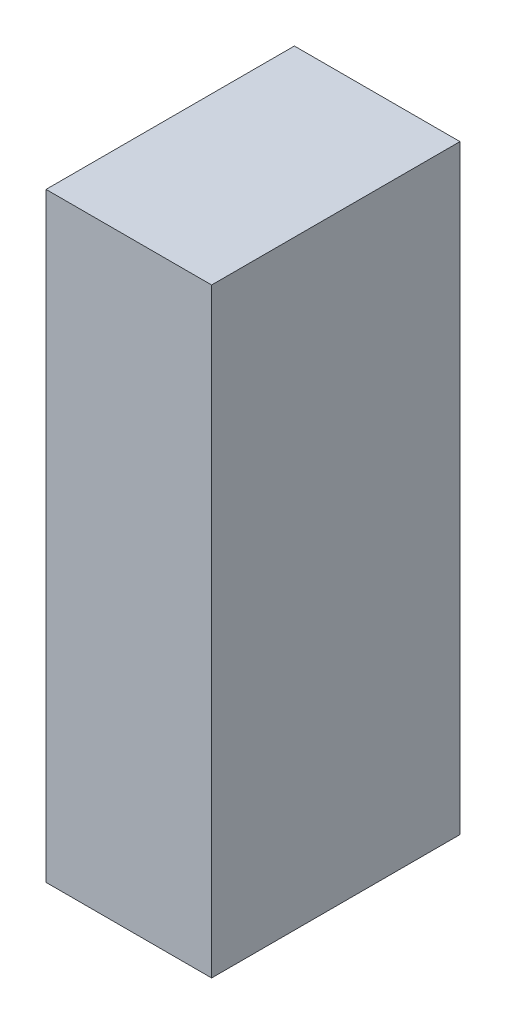
ISO-10303-21;
HEADER;
FILE_DESCRIPTION(('STEP AP214'),'2;1');
FILE_NAME('part.step','',(''),(''),'','','');
FILE_SCHEMA(('AUTOMOTIVE_DESIGN { 1 0 10303 214 1 1 1 1 }'));
ENDSEC;
DATA;
#1=APPLICATION_CONTEXT('core data for automotive mechanical design processes');
#2=APPLICATION_PROTOCOL_DEFINITION('international standard','automotive_design',2000,#1);
#3=PRODUCT_CONTEXT('',#1,'mechanical');
#4=PRODUCT('Part','Part','',(#3));
#5=PRODUCT_RELATED_PRODUCT_CATEGORY('part','',(#4));
#6=PRODUCT_DEFINITION_FORMATION('','',#4);
#7=PRODUCT_DEFINITION_CONTEXT('part definition',#1,'design');
#8=PRODUCT_DEFINITION('design','',#6,#7);
#9=PRODUCT_DEFINITION_SHAPE('','',#8);
#10=(LENGTH_UNIT() NAMED_UNIT(*) SI_UNIT(.MILLI.,.METRE.));
#11=(NAMED_UNIT(*) PLANE_ANGLE_UNIT() SI_UNIT($,.RADIAN.));
#12=(NAMED_UNIT(*) SI_UNIT($,.STERADIAN.) SOLID_ANGLE_UNIT());
#13=UNCERTAINTY_MEASURE_WITH_UNIT(LENGTH_MEASURE(1.E-05),#10,'distance_accuracy_value','');
#14=(GEOMETRIC_REPRESENTATION_CONTEXT(3) GLOBAL_UNCERTAINTY_ASSIGNED_CONTEXT((#13)) GLOBAL_UNIT_ASSIGNED_CONTEXT((#10,
#11,#12)) REPRESENTATION_CONTEXT('',''));
#15=CARTESIAN_POINT('',(0.,0.,0.));
#16=DIRECTION('',(0.,0.,1.));
#17=DIRECTION('',(1.,0.,0.));
#18=AXIS2_PLACEMENT_3D('',#15,#16,#17);
#19=CARTESIAN_POINT('',(0.699981689453125,0.725006103515625,0.));
#20=DIRECTION('',(-1.,0.,0.));
#21=DIRECTION('',(0.,-1.,0.));
#22=AXIS2_PLACEMENT_3D('',#19,#20,#21);
#23=PLANE('',#22);
#24=DIRECTION('',(0.,-1.,0.));
#25=VECTOR('',#24,1.);
#26=CARTESIAN_POINT('',(0.699981689453125,0.725006103515625,0.));
#27=LINE('',#26,#25);
#28=CARTESIAN_POINT('',(0.699981689453125,0.725006103515625,0.));
#29=VERTEX_POINT('',#28);
#30=CARTESIAN_POINT('',(0.699981689453125,-0.724998474121094,0.));
#31=VERTEX_POINT('',#30);
#32=EDGE_CURVE('E11',#29,#31,#27,.T.);
#33=ORIENTED_EDGE('',*,*,#32,.T.);
#34=DIRECTION('',(0.,0.,1.));
#35=VECTOR('',#34,1.);
#36=CARTESIAN_POINT('',(0.699981689453125,-0.724998474121094,0.));
#37=LINE('',#36,#35);
#38=CARTESIAN_POINT('',(0.699981689453125,-0.724998474121094,0.599998772144318));
#39=VERTEX_POINT('',#38);
#40=EDGE_CURVE('E88',#31,#39,#37,.T.);
#41=ORIENTED_EDGE('',*,*,#40,.T.);
#42=DIRECTION('',(0.,-1.,0.));
#43=VECTOR('',#42,1.);
#44=CARTESIAN_POINT('',(0.699981689453125,0.725006103515625,0.599998772144318));
#45=LINE('',#44,#43);
#46=CARTESIAN_POINT('',(0.699981689453125,0.725006103515625,0.599998772144318));
#47=VERTEX_POINT('',#46);
#48=EDGE_CURVE('E83',#47,#39,#45,.T.);
#49=ORIENTED_EDGE('',*,*,#48,.F.);
#50=DIRECTION('',(0.,0.,1.));
#51=VECTOR('',#50,1.);
#52=CARTESIAN_POINT('',(0.699981689453125,0.725006103515625,0.));
#53=LINE('',#52,#51);
#54=EDGE_CURVE('E72',#29,#47,#53,.T.);
#55=ORIENTED_EDGE('',*,*,#54,.F.);
#56=EDGE_LOOP('',(#33,#41,#49,#55));
#57=FACE_BOUND('',#56,.T.);
#58=ADVANCED_FACE('F17',(#57),#23,.T.);
#59=CARTESIAN_POINT('',(0.699981689453125,-0.724998474121094,0.));
#60=DIRECTION('',(0.,-1.,0.));
#61=DIRECTION('',(1.,0.,0.));
#62=AXIS2_PLACEMENT_3D('',#59,#60,#61);
#63=PLANE('',#62);
#64=DIRECTION('',(1.,0.,0.));
#65=VECTOR('',#64,1.);
#66=CARTESIAN_POINT('',(0.699981689453125,-0.724998474121094,0.));
#67=LINE('',#66,#65);
#68=CARTESIAN_POINT('',(1.10000610351563,-0.724998474121094,0.));
#69=VERTEX_POINT('',#68);
#70=EDGE_CURVE('E24',#31,#69,#67,.T.);
#71=ORIENTED_EDGE('',*,*,#70,.T.);
#72=DIRECTION('',(0.,0.,1.));
#73=VECTOR('',#72,1.);
#74=CARTESIAN_POINT('',(1.10000610351563,-0.724998474121094,0.));
#75=LINE('',#74,#73);
#76=CARTESIAN_POINT('',(1.10000610351563,-0.724998474121094,0.599998772144318));
#77=VERTEX_POINT('',#76);
#78=EDGE_CURVE('E85',#69,#77,#75,.T.);
#79=ORIENTED_EDGE('',*,*,#78,.T.);
#80=DIRECTION('',(1.,0.,0.));
#81=VECTOR('',#80,1.);
#82=CARTESIAN_POINT('',(0.699981689453125,-0.724998474121094,0.599998772144318));
#83=LINE('',#82,#81);
#84=EDGE_CURVE('E66',#39,#77,#83,.T.);
#85=ORIENTED_EDGE('',*,*,#84,.F.);
#86=ORIENTED_EDGE('',*,*,#40,.F.);
#87=EDGE_LOOP('',(#71,#79,#85,#86));
#88=FACE_BOUND('',#87,.T.);
#89=ADVANCED_FACE('F89',(#88),#63,.T.);
#90=CARTESIAN_POINT('',(1.10000610351563,-0.724998474121094,0.));
#91=DIRECTION('',(1.,0.,0.));
#92=DIRECTION('',(0.,1.,0.));
#93=AXIS2_PLACEMENT_3D('',#90,#91,#92);
#94=PLANE('',#93);
#95=DIRECTION('',(0.,1.,0.));
#96=VECTOR('',#95,1.);
#97=CARTESIAN_POINT('',(1.10000610351563,-0.724998474121094,0.));
#98=LINE('',#97,#96);
#99=CARTESIAN_POINT('',(1.10000610351563,0.725006103515625,0.));
#100=VERTEX_POINT('',#99);
#101=EDGE_CURVE('E62',#69,#100,#98,.T.);
#102=ORIENTED_EDGE('',*,*,#101,.T.);
#103=DIRECTION('',(0.,0.,1.));
#104=VECTOR('',#103,1.);
#105=CARTESIAN_POINT('',(1.10000610351563,0.725006103515625,0.));
#106=LINE('',#105,#104);
#107=CARTESIAN_POINT('',(1.10000610351563,0.725006103515625,0.599998772144318));
#108=VERTEX_POINT('',#107);
#109=EDGE_CURVE('E55',#100,#108,#106,.T.);
#110=ORIENTED_EDGE('',*,*,#109,.T.);
#111=DIRECTION('',(0.,1.,0.));
#112=VECTOR('',#111,1.);
#113=CARTESIAN_POINT('',(1.10000610351563,-0.724998474121094,0.599998772144318));
#114=LINE('',#113,#112);
#115=EDGE_CURVE('E59',#77,#108,#114,.T.);
#116=ORIENTED_EDGE('',*,*,#115,.F.);
#117=ORIENTED_EDGE('',*,*,#78,.F.);
#118=EDGE_LOOP('',(#102,#110,#116,#117));
#119=FACE_BOUND('',#118,.T.);
#120=ADVANCED_FACE('F57',(#119),#94,.T.);
#121=CARTESIAN_POINT('',(1.10000610351563,0.725006103515625,0.));
#122=DIRECTION('',(0.,1.,0.));
#123=DIRECTION('',(-1.,0.,0.));
#124=AXIS2_PLACEMENT_3D('',#121,#122,#123);
#125=PLANE('',#124);
#126=DIRECTION('',(-1.,0.,0.));
#127=VECTOR('',#126,1.);
#128=CARTESIAN_POINT('',(1.10000610351563,0.725006103515625,0.));
#129=LINE('',#128,#127);
#130=EDGE_CURVE('E65',#100,#29,#129,.T.);
#131=ORIENTED_EDGE('',*,*,#130,.T.);
#132=ORIENTED_EDGE('',*,*,#54,.T.);
#133=DIRECTION('',(-1.,0.,0.));
#134=VECTOR('',#133,1.);
#135=CARTESIAN_POINT('',(1.10000610351563,0.725006103515625,0.599998772144318));
#136=LINE('',#135,#134);
#137=EDGE_CURVE('E70',#108,#47,#136,.T.);
#138=ORIENTED_EDGE('',*,*,#137,.F.);
#139=ORIENTED_EDGE('',*,*,#109,.F.);
#140=EDGE_LOOP('',(#131,#132,#138,#139));
#141=FACE_BOUND('',#140,.T.);
#142=ADVANCED_FACE('F71',(#141),#125,.T.);
#143=CARTESIAN_POINT('',(-489.75,-105.025001525879,0.599998772144318));
#144=DIRECTION('',(0.,0.,1.));
#145=DIRECTION('',(1.,0.,0.));
#146=AXIS2_PLACEMENT_3D('',#143,#144,#145);
#147=PLANE('',#146);
#148=ORIENTED_EDGE('',*,*,#48,.T.);
#149=ORIENTED_EDGE('',*,*,#84,.T.);
#150=ORIENTED_EDGE('',*,*,#115,.T.);
#151=ORIENTED_EDGE('',*,*,#137,.T.);
#152=EDGE_LOOP('',(#148,#149,#150,#151));
#153=FACE_BOUND('',#152,.T.);
#154=ADVANCED_FACE('F76',(#153),#147,.T.);
#155=CARTESIAN_POINT('',(-489.75,-105.025001525879,0.));
#156=DIRECTION('',(0.,0.,1.));
#157=DIRECTION('',(1.,0.,0.));
#158=AXIS2_PLACEMENT_3D('',#155,#156,#157);
#159=PLANE('',#158);
#160=ORIENTED_EDGE('',*,*,#130,.F.);
#161=ORIENTED_EDGE('',*,*,#101,.F.);
#162=ORIENTED_EDGE('',*,*,#70,.F.);
#163=ORIENTED_EDGE('',*,*,#32,.F.);
#164=EDGE_LOOP('',(#160,#161,#162,#163));
#165=FACE_BOUND('',#164,.T.);
#166=ADVANCED_FACE('F91',(#165),#159,.F.);
#167=CLOSED_SHELL('',(#58,#89,#120,#142,#154,#166));
#168=MANIFOLD_SOLID_BREP('B1',#167);
#169=ADVANCED_BREP_SHAPE_REPRESENTATION('',(#18,#168),#14);
#170=SHAPE_DEFINITION_REPRESENTATION(#9,#169);
ENDSEC;
END-ISO-10303-21;
